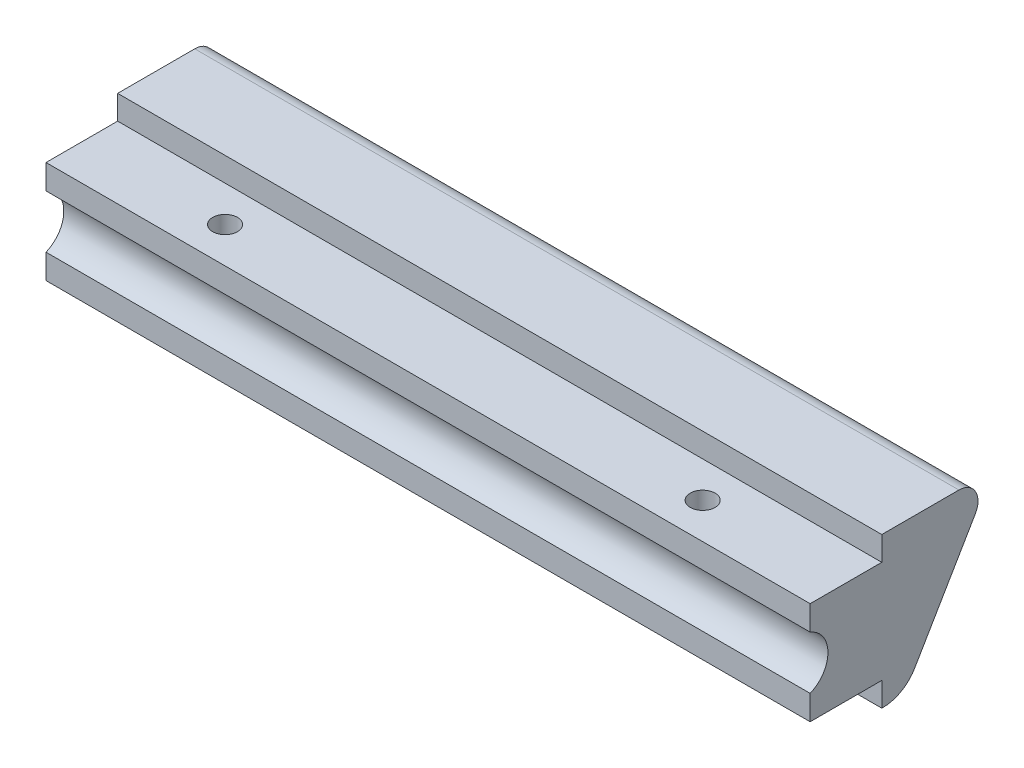
ISO-10303-21;
HEADER;
FILE_DESCRIPTION(('STEP AP214'),'2;1');
FILE_NAME('part.step','',(''),(''),'','','');
FILE_SCHEMA(('AUTOMOTIVE_DESIGN { 1 0 10303 214 1 1 1 1 }'));
ENDSEC;
DATA;
#1=APPLICATION_CONTEXT('core data for automotive mechanical design processes');
#2=APPLICATION_PROTOCOL_DEFINITION('international standard','automotive_design',2000,#1);
#3=PRODUCT_CONTEXT('',#1,'mechanical');
#4=PRODUCT('Part','Part','',(#3));
#5=PRODUCT_RELATED_PRODUCT_CATEGORY('part','',(#4));
#6=PRODUCT_DEFINITION_FORMATION('','',#4);
#7=PRODUCT_DEFINITION_CONTEXT('part definition',#1,'design');
#8=PRODUCT_DEFINITION('design','',#6,#7);
#9=PRODUCT_DEFINITION_SHAPE('','',#8);
#10=(LENGTH_UNIT() NAMED_UNIT(*) SI_UNIT(.MILLI.,.METRE.));
#11=(NAMED_UNIT(*) PLANE_ANGLE_UNIT() SI_UNIT($,.RADIAN.));
#12=(NAMED_UNIT(*) SI_UNIT($,.STERADIAN.) SOLID_ANGLE_UNIT());
#13=UNCERTAINTY_MEASURE_WITH_UNIT(LENGTH_MEASURE(1.E-05),#10,'distance_accuracy_value','');
#14=(GEOMETRIC_REPRESENTATION_CONTEXT(3) GLOBAL_UNCERTAINTY_ASSIGNED_CONTEXT((#13)) GLOBAL_UNIT_ASSIGNED_CONTEXT((#10,
#11,#12)) REPRESENTATION_CONTEXT('',''));
#15=CARTESIAN_POINT('',(0.,0.,0.));
#16=DIRECTION('',(0.,0.,1.));
#17=DIRECTION('',(1.,0.,0.));
#18=AXIS2_PLACEMENT_3D('',#15,#16,#17);
#19=CARTESIAN_POINT('',(101.6,16.7996,0.));
#20=DIRECTION('',(0.,0.,-1.));
#21=DIRECTION('',(0.,1.,0.));
#22=AXIS2_PLACEMENT_3D('',#19,#20,#21);
#23=PLANE('',#22);
#24=DIRECTION('',(0.,-1.,0.));
#25=VECTOR('',#24,1.);
#26=CARTESIAN_POINT('',(101.6,16.7996,0.));
#27=LINE('',#26,#25);
#28=CARTESIAN_POINT('',(101.6,6.4737188141613,0.));
#29=VERTEX_POINT('',#28);
#30=CARTESIAN_POINT('',(101.6,3.2004,0.));
#31=VERTEX_POINT('',#30);
#32=EDGE_CURVE('E138',#29,#31,#27,.T.);
#33=ORIENTED_EDGE('',*,*,#32,.F.);
#34=DIRECTION('',(-1.,0.,0.));
#35=VECTOR('',#34,1.);
#36=CARTESIAN_POINT('',(109.039264117156,6.4737188141613,0.));
#37=LINE('',#36,#35);
#38=CARTESIAN_POINT('',(0.,6.4737188141613,0.));
#39=VERTEX_POINT('',#38);
#40=EDGE_CURVE('E124',#29,#39,#37,.T.);
#41=ORIENTED_EDGE('',*,*,#40,.T.);
#42=DIRECTION('',(0.,-1.,0.));
#43=VECTOR('',#42,1.);
#44=CARTESIAN_POINT('',(0.,16.7996,0.));
#45=LINE('',#44,#43);
#46=CARTESIAN_POINT('',(0.,3.2004,0.));
#47=VERTEX_POINT('',#46);
#48=EDGE_CURVE('E136',#39,#47,#45,.T.);
#49=ORIENTED_EDGE('',*,*,#48,.T.);
#50=DIRECTION('',(-1.,0.,0.));
#51=VECTOR('',#50,1.);
#52=CARTESIAN_POINT('',(101.6,3.2004,0.));
#53=LINE('',#52,#51);
#54=EDGE_CURVE('E174',#31,#47,#53,.T.);
#55=ORIENTED_EDGE('',*,*,#54,.F.);
#56=EDGE_LOOP('',(#33,#41,#49,#55));
#57=FACE_BOUND('',#56,.T.);
#58=ADVANCED_FACE('F33',(#57),#23,.F.);
#59=CARTESIAN_POINT('',(101.6,20.,-24.2156234533446));
#60=DIRECTION('',(0.,-1.,0.));
#61=DIRECTION('',(0.,0.,-1.));
#62=AXIS2_PLACEMENT_3D('',#59,#60,#61);
#63=PLANE('',#62);
#64=DIRECTION('',(0.,0.,1.));
#65=VECTOR('',#64,1.);
#66=CARTESIAN_POINT('',(101.6,20.,-24.2156234533446));
#67=LINE('',#66,#65);
#68=CARTESIAN_POINT('',(101.6,20.,-19.7792045559382));
#69=VERTEX_POINT('',#68);
#70=CARTESIAN_POINT('',(101.6,20.,-9.525));
#71=VERTEX_POINT('',#70);
#72=EDGE_CURVE('E160',#69,#71,#67,.T.);
#73=ORIENTED_EDGE('',*,*,#72,.F.);
#74=DIRECTION('',(-1.,0.,0.));
#75=VECTOR('',#74,1.);
#76=CARTESIAN_POINT('',(101.6,20.,-19.7792045559382));
#77=LINE('',#76,#75);
#78=CARTESIAN_POINT('',(0.,20.,-19.7792045559382));
#79=VERTEX_POINT('',#78);
#80=EDGE_CURVE('E185',#69,#79,#77,.T.);
#81=ORIENTED_EDGE('',*,*,#80,.T.);
#82=DIRECTION('',(0.,0.,1.));
#83=VECTOR('',#82,1.);
#84=CARTESIAN_POINT('',(0.,20.,-24.2156234533446));
#85=LINE('',#84,#83);
#86=CARTESIAN_POINT('',(0.,20.,-9.525));
#87=VERTEX_POINT('',#86);
#88=EDGE_CURVE('E193',#79,#87,#85,.T.);
#89=ORIENTED_EDGE('',*,*,#88,.T.);
#90=DIRECTION('',(-1.,0.,0.));
#91=VECTOR('',#90,1.);
#92=CARTESIAN_POINT('',(101.6,20.,-9.525));
#93=LINE('',#92,#91);
#94=EDGE_CURVE('E182',#71,#87,#93,.T.);
#95=ORIENTED_EDGE('',*,*,#94,.F.);
#96=EDGE_LOOP('',(#73,#81,#89,#95));
#97=FACE_BOUND('',#96,.T.);
#98=ADVANCED_FACE('F191',(#97),#63,.F.);
#99=CARTESIAN_POINT('',(101.6,20.,-9.525));
#100=DIRECTION('',(0.,0.,-1.));
#101=DIRECTION('',(-1.,0.,0.));
#102=AXIS2_PLACEMENT_3D('',#99,#100,#101);
#103=PLANE('',#102);
#104=DIRECTION('',(0.,-1.,0.));
#105=VECTOR('',#104,1.);
#106=CARTESIAN_POINT('',(0.,20.,-9.525));
#107=LINE('',#106,#105);
#108=CARTESIAN_POINT('',(0.,16.7996,-9.525));
#109=VERTEX_POINT('',#108);
#110=EDGE_CURVE('E147',#87,#109,#107,.T.);
#111=ORIENTED_EDGE('',*,*,#110,.T.);
#112=DIRECTION('',(-1.,0.,0.));
#113=VECTOR('',#112,1.);
#114=CARTESIAN_POINT('',(101.6,16.7996,-9.525));
#115=LINE('',#114,#113);
#116=CARTESIAN_POINT('',(101.6,16.7996,-9.525));
#117=VERTEX_POINT('',#116);
#118=EDGE_CURVE('E179',#117,#109,#115,.T.);
#119=ORIENTED_EDGE('',*,*,#118,.F.);
#120=DIRECTION('',(0.,-1.,0.));
#121=VECTOR('',#120,1.);
#122=CARTESIAN_POINT('',(101.6,20.,-9.525));
#123=LINE('',#122,#121);
#124=EDGE_CURVE('E216',#71,#117,#123,.T.);
#125=ORIENTED_EDGE('',*,*,#124,.F.);
#126=ORIENTED_EDGE('',*,*,#94,.T.);
#127=EDGE_LOOP('',(#111,#119,#125,#126));
#128=FACE_BOUND('',#127,.T.);
#129=ADVANCED_FACE('F238',(#128),#103,.F.);
#130=CARTESIAN_POINT('',(101.6,16.7996,-9.525));
#131=DIRECTION('',(0.,-1.,0.));
#132=DIRECTION('',(0.,0.,-1.));
#133=AXIS2_PLACEMENT_3D('',#130,#131,#132);
#134=PLANE('',#133);
#135=CARTESIAN_POINT('',(19.05,16.7996,-4.76250000000001));
#136=DIRECTION('',(0.,1.,0.));
#137=DIRECTION('',(0.,0.,1.));
#138=AXIS2_PLACEMENT_3D('',#135,#136,#137);
#139=CIRCLE('',#138,1.651);
#140=CARTESIAN_POINT('',(19.05,16.7996,-3.11150000000001));
#141=VERTEX_POINT('',#140);
#142=EDGE_CURVE('E223',#141,#141,#139,.T.);
#143=ORIENTED_EDGE('',*,*,#142,.F.);
#144=EDGE_LOOP('',(#143));
#145=FACE_BOUND('',#144,.T.);
#146=CARTESIAN_POINT('',(82.55,16.7996,-4.76250000000005));
#147=DIRECTION('',(0.,1.,0.));
#148=DIRECTION('',(0.,0.,1.));
#149=AXIS2_PLACEMENT_3D('',#146,#147,#148);
#150=CIRCLE('',#149,1.65100000000001);
#151=CARTESIAN_POINT('',(82.55,16.7996,-3.11150000000004));
#152=VERTEX_POINT('',#151);
#153=EDGE_CURVE('E224',#152,#152,#150,.T.);
#154=ORIENTED_EDGE('',*,*,#153,.F.);
#155=EDGE_LOOP('',(#154));
#156=FACE_BOUND('',#155,.T.);
#157=DIRECTION('',(0.,0.,1.));
#158=VECTOR('',#157,1.);
#159=CARTESIAN_POINT('',(0.,16.7996,-9.525));
#160=LINE('',#159,#158);
#161=CARTESIAN_POINT('',(0.,16.7996,0.));
#162=VERTEX_POINT('',#161);
#163=EDGE_CURVE('E145',#109,#162,#160,.T.);
#164=ORIENTED_EDGE('',*,*,#163,.T.);
#165=DIRECTION('',(-1.,0.,0.));
#166=VECTOR('',#165,1.);
#167=CARTESIAN_POINT('',(101.6,16.7996,0.));
#168=LINE('',#167,#166);
#169=CARTESIAN_POINT('',(101.6,16.7996,0.));
#170=VERTEX_POINT('',#169);
#171=EDGE_CURVE('E176',#170,#162,#168,.T.);
#172=ORIENTED_EDGE('',*,*,#171,.F.);
#173=DIRECTION('',(0.,0.,1.));
#174=VECTOR('',#173,1.);
#175=CARTESIAN_POINT('',(101.6,16.7996,-9.525));
#176=LINE('',#175,#174);
#177=EDGE_CURVE('E214',#117,#170,#176,.T.);
#178=ORIENTED_EDGE('',*,*,#177,.F.);
#179=ORIENTED_EDGE('',*,*,#118,.T.);
#180=EDGE_LOOP('',(#164,#172,#178,#179));
#181=FACE_BOUND('',#180,.T.);
#182=ADVANCED_FACE('F234',(#145,#156,#181),#134,.F.);
#183=CARTESIAN_POINT('',(0.,13.5262811858387,0.));
#184=VERTEX_POINT('',#183);
#185=EDGE_CURVE('E144',#162,#184,#45,.T.);
#186=ORIENTED_EDGE('',*,*,#185,.T.);
#187=DIRECTION('',(-1.,0.,0.));
#188=VECTOR('',#187,1.);
#189=CARTESIAN_POINT('',(109.039264117156,13.5262811858387,0.));
#190=LINE('',#189,#188);
#191=CARTESIAN_POINT('',(101.6,13.5262811858387,0.));
#192=VERTEX_POINT('',#191);
#193=EDGE_CURVE('E127',#192,#184,#190,.T.);
#194=ORIENTED_EDGE('',*,*,#193,.F.);
#195=EDGE_CURVE('E211',#170,#192,#27,.T.);
#196=ORIENTED_EDGE('',*,*,#195,.F.);
#197=ORIENTED_EDGE('',*,*,#171,.T.);
#198=EDGE_LOOP('',(#186,#194,#196,#197));
#199=FACE_BOUND('',#198,.T.);
#200=ADVANCED_FACE('F237',(#199),#23,.F.);
#201=CARTESIAN_POINT('',(101.6,3.2004,0.));
#202=DIRECTION('',(0.,1.,0.));
#203=DIRECTION('',(0.,0.,1.));
#204=AXIS2_PLACEMENT_3D('',#201,#202,#203);
#205=PLANE('',#204);
#206=CARTESIAN_POINT('',(19.05,3.2004,-4.76250000000001));
#207=DIRECTION('',(0.,1.,0.));
#208=DIRECTION('',(0.,0.,1.));
#209=AXIS2_PLACEMENT_3D('',#206,#207,#208);
#210=CIRCLE('',#209,1.651);
#211=CARTESIAN_POINT('',(19.05,3.2004,-3.11150000000002));
#212=VERTEX_POINT('',#211);
#213=EDGE_CURVE('E131',#212,#212,#210,.F.);
#214=ORIENTED_EDGE('',*,*,#213,.F.);
#215=EDGE_LOOP('',(#214));
#216=FACE_BOUND('',#215,.T.);
#217=CARTESIAN_POINT('',(82.55,3.2004,-4.76250000000005));
#218=DIRECTION('',(0.,1.,0.));
#219=DIRECTION('',(0.,0.,1.));
#220=AXIS2_PLACEMENT_3D('',#217,#218,#219);
#221=CIRCLE('',#220,1.65100000000001);
#222=CARTESIAN_POINT('',(82.55,3.2004,-3.11150000000005));
#223=VERTEX_POINT('',#222);
#224=EDGE_CURVE('E220',#223,#223,#221,.F.);
#225=ORIENTED_EDGE('',*,*,#224,.F.);
#226=EDGE_LOOP('',(#225));
#227=FACE_BOUND('',#226,.T.);
#228=DIRECTION('',(0.,0.,-1.));
#229=VECTOR('',#228,1.);
#230=CARTESIAN_POINT('',(0.,3.2004,0.));
#231=LINE('',#230,#229);
#232=CARTESIAN_POINT('',(0.,3.2004,-9.525));
#233=VERTEX_POINT('',#232);
#234=EDGE_CURVE('E143',#47,#233,#231,.T.);
#235=ORIENTED_EDGE('',*,*,#234,.T.);
#236=DIRECTION('',(-1.,0.,0.));
#237=VECTOR('',#236,1.);
#238=CARTESIAN_POINT('',(101.6,3.2004,-9.525));
#239=LINE('',#238,#237);
#240=CARTESIAN_POINT('',(101.6,3.2004,-9.525));
#241=VERTEX_POINT('',#240);
#242=EDGE_CURVE('E171',#241,#233,#239,.T.);
#243=ORIENTED_EDGE('',*,*,#242,.F.);
#244=DIRECTION('',(0.,0.,-1.));
#245=VECTOR('',#244,1.);
#246=CARTESIAN_POINT('',(101.6,3.2004,0.));
#247=LINE('',#246,#245);
#248=EDGE_CURVE('E209',#31,#241,#247,.T.);
#249=ORIENTED_EDGE('',*,*,#248,.F.);
#250=ORIENTED_EDGE('',*,*,#54,.T.);
#251=EDGE_LOOP('',(#235,#243,#249,#250));
#252=FACE_BOUND('',#251,.T.);
#253=ADVANCED_FACE('F262',(#216,#227,#252),#205,.F.);
#254=CARTESIAN_POINT('',(101.6,3.2004,-9.525));
#255=DIRECTION('',(0.,0.,-1.));
#256=DIRECTION('',(0.,1.,0.));
#257=AXIS2_PLACEMENT_3D('',#254,#255,#256);
#258=PLANE('',#257);
#259=DIRECTION('',(0.,-1.,0.));
#260=VECTOR('',#259,1.);
#261=CARTESIAN_POINT('',(0.,3.2004,-9.525));
#262=LINE('',#261,#260);
#263=CARTESIAN_POINT('',(0.,0.,-9.525));
#264=VERTEX_POINT('',#263);
#265=EDGE_CURVE('E152',#233,#264,#262,.T.);
#266=ORIENTED_EDGE('',*,*,#265,.T.);
#267=DIRECTION('',(-1.,0.,0.));
#268=VECTOR('',#267,1.);
#269=CARTESIAN_POINT('',(101.6,0.,-9.525));
#270=LINE('',#269,#268);
#271=CARTESIAN_POINT('',(101.6,0.,-9.525));
#272=VERTEX_POINT('',#271);
#273=EDGE_CURVE('E168',#272,#264,#270,.T.);
#274=ORIENTED_EDGE('',*,*,#273,.F.);
#275=DIRECTION('',(0.,-1.,0.));
#276=VECTOR('',#275,1.);
#277=CARTESIAN_POINT('',(101.6,3.2004,-9.525));
#278=LINE('',#277,#276);
#279=EDGE_CURVE('E207',#241,#272,#278,.T.);
#280=ORIENTED_EDGE('',*,*,#279,.F.);
#281=ORIENTED_EDGE('',*,*,#242,.T.);
#282=EDGE_LOOP('',(#266,#274,#280,#281));
#283=FACE_BOUND('',#282,.T.);
#284=ADVANCED_FACE('F266',(#283),#258,.F.);
#285=CARTESIAN_POINT('',(101.6,0.,-9.67200120834093));
#286=DIRECTION('',(0.,1.,0.));
#287=DIRECTION('',(0.,0.,1.));
#288=AXIS2_PLACEMENT_3D('',#285,#286,#287);
#289=PLANE('',#288);
#290=DIRECTION('',(0.,0.,-1.));
#291=VECTOR('',#290,1.);
#292=CARTESIAN_POINT('',(0.,0.,-9.67200120834093));
#293=LINE('',#292,#291);
#294=CARTESIAN_POINT('',(0.,0.,-9.67200120834093));
#295=VERTEX_POINT('',#294);
#296=EDGE_CURVE('E154',#264,#295,#293,.T.);
#297=ORIENTED_EDGE('',*,*,#296,.T.);
#298=DIRECTION('',(-1.,0.,0.));
#299=VECTOR('',#298,1.);
#300=CARTESIAN_POINT('',(101.6,0.,-9.67200120834093));
#301=LINE('',#300,#299);
#302=CARTESIAN_POINT('',(101.6,0.,-9.67200120834093));
#303=VERTEX_POINT('',#302);
#304=EDGE_CURVE('E164',#303,#295,#301,.T.);
#305=ORIENTED_EDGE('',*,*,#304,.F.);
#306=DIRECTION('',(0.,0.,-1.));
#307=VECTOR('',#306,1.);
#308=CARTESIAN_POINT('',(101.6,0.,-9.67200120834093));
#309=LINE('',#308,#307);
#310=EDGE_CURVE('E205',#272,#303,#309,.T.);
#311=ORIENTED_EDGE('',*,*,#310,.F.);
#312=ORIENTED_EDGE('',*,*,#273,.T.);
#313=EDGE_LOOP('',(#297,#305,#311,#312));
#314=FACE_BOUND('',#313,.T.);
#315=ADVANCED_FACE('F271',(#314),#289,.F.);
#316=CARTESIAN_POINT('',(101.6,4.89533435134192,-9.67200120834093));
#317=DIRECTION('',(-1.,0.,0.));
#318=DIRECTION('',(0.,0.,1.));
#319=AXIS2_PLACEMENT_3D('',#316,#317,#318);
#320=CYLINDRICAL_SURFACE('',#319,4.89533435134192);
#321=CARTESIAN_POINT('',(0.,4.89533435134192,-9.67200120834093));
#322=DIRECTION('',(1.,0.,0.));
#323=DIRECTION('',(0.,0.,1.));
#324=AXIS2_PLACEMENT_3D('',#321,#322,#323);
#325=CIRCLE('',#324,4.89533435134192);
#326=CARTESIAN_POINT('',(0.,2.4170390254288,-13.893653809987));
#327=VERTEX_POINT('',#326);
#328=EDGE_CURVE('E156',#295,#327,#325,.T.);
#329=ORIENTED_EDGE('',*,*,#328,.T.);
#330=DIRECTION('',(-1.,0.,0.));
#331=VECTOR('',#330,1.);
#332=CARTESIAN_POINT('',(101.6,2.4170390254288,-13.893653809987));
#333=LINE('',#332,#331);
#334=CARTESIAN_POINT('',(101.6,2.4170390254288,-13.893653809987));
#335=VERTEX_POINT('',#334);
#336=EDGE_CURVE('E161',#335,#327,#333,.T.);
#337=ORIENTED_EDGE('',*,*,#336,.F.);
#338=CARTESIAN_POINT('',(101.6,4.89533435134192,-9.67200120834093));
#339=DIRECTION('',(1.,0.,0.));
#340=DIRECTION('',(0.,0.,1.));
#341=AXIS2_PLACEMENT_3D('',#338,#339,#340);
#342=CIRCLE('',#341,4.89533435134192);
#343=EDGE_CURVE('E203',#303,#335,#342,.T.);
#344=ORIENTED_EDGE('',*,*,#343,.F.);
#345=ORIENTED_EDGE('',*,*,#304,.T.);
#346=EDGE_LOOP('',(#329,#337,#344,#345));
#347=FACE_BOUND('',#346,.T.);
#348=ADVANCED_FACE('F279',(#347),#320,.T.);
#349=CARTESIAN_POINT('',(101.6,20.,-24.2156234533446));
#350=DIRECTION('',(0.,0.506256600273639,0.862382893313276));
#351=DIRECTION('',(0.,-0.862382893313276,0.506256600273639));
#352=AXIS2_PLACEMENT_3D('',#349,#350,#351);
#353=PLANE('',#352);
#354=DIRECTION('',(0.,0.862382893313276,-0.506256600273639));
#355=VECTOR('',#354,1.);
#356=CARTESIAN_POINT('',(0.,20.,-24.2156234533446));
#357=LINE('',#356,#355);
#358=CARTESIAN_POINT('',(0.,16.174108235305,-21.9696571049539));
#359=VERTEX_POINT('',#358);
#360=EDGE_CURVE('E158',#327,#359,#357,.T.);
#361=ORIENTED_EDGE('',*,*,#360,.T.);
#362=DIRECTION('',(-1.,0.,0.));
#363=VECTOR('',#362,1.);
#364=CARTESIAN_POINT('',(101.6,16.174108235305,-21.9696571049539));
#365=LINE('',#364,#363);
#366=CARTESIAN_POINT('',(101.6,16.174108235305,-21.9696571049539));
#367=VERTEX_POINT('',#366);
#368=EDGE_CURVE('E41',#359,#367,#365,.F.);
#369=ORIENTED_EDGE('',*,*,#368,.T.);
#370=DIRECTION('',(0.,0.862382893313276,-0.506256600273639));
#371=VECTOR('',#370,1.);
#372=CARTESIAN_POINT('',(101.6,20.,-24.2156234533446));
#373=LINE('',#372,#371);
#374=EDGE_CURVE('E165',#335,#367,#373,.T.);
#375=ORIENTED_EDGE('',*,*,#374,.F.);
#376=ORIENTED_EDGE('',*,*,#336,.T.);
#377=EDGE_LOOP('',(#361,#369,#375,#376));
#378=FACE_BOUND('',#377,.T.);
#379=ADVANCED_FACE('F283',(#378),#353,.F.);
#380=CARTESIAN_POINT('',(101.6,4.89533435134192,-9.67200120834093));
#381=DIRECTION('',(-1.,0.,0.));
#382=DIRECTION('',(0.,0.,1.));
#383=AXIS2_PLACEMENT_3D('',#380,#381,#382);
#384=PLANE('',#383);
#385=ORIENTED_EDGE('',*,*,#374,.T.);
#386=CARTESIAN_POINT('',(101.6,17.46,-19.7792045559382));
#387=DIRECTION('',(-1.,0.,0.));
#388=DIRECTION('',(0.,0.,1.));
#389=AXIS2_PLACEMENT_3D('',#386,#387,#388);
#390=CIRCLE('',#389,2.54);
#391=EDGE_CURVE('E11',#367,#69,#390,.F.);
#392=ORIENTED_EDGE('',*,*,#391,.T.);
#393=ORIENTED_EDGE('',*,*,#72,.T.);
#394=ORIENTED_EDGE('',*,*,#124,.T.);
#395=ORIENTED_EDGE('',*,*,#177,.T.);
#396=ORIENTED_EDGE('',*,*,#195,.T.);
#397=CARTESIAN_POINT('',(101.6,10.,1.44272));
#398=DIRECTION('',(-1.,0.,0.));
#399=DIRECTION('',(0.,0.,1.));
#400=AXIS2_PLACEMENT_3D('',#397,#398,#399);
#401=CIRCLE('',#400,3.81);
#402=EDGE_CURVE('E198',#29,#192,#401,.F.);
#403=ORIENTED_EDGE('',*,*,#402,.F.);
#404=ORIENTED_EDGE('',*,*,#32,.T.);
#405=ORIENTED_EDGE('',*,*,#248,.T.);
#406=ORIENTED_EDGE('',*,*,#279,.T.);
#407=ORIENTED_EDGE('',*,*,#310,.T.);
#408=ORIENTED_EDGE('',*,*,#343,.T.);
#409=EDGE_LOOP('',(#385,#392,#393,#394,#395,#396,#403,#404,#405,#406,#407,#408));
#410=FACE_BOUND('',#409,.T.);
#411=ADVANCED_FACE('F248',(#410),#384,.F.);
#412=CARTESIAN_POINT('',(0.,4.89533435134192,-9.67200120834093));
#413=DIRECTION('',(-1.,0.,0.));
#414=DIRECTION('',(0.,0.,1.));
#415=AXIS2_PLACEMENT_3D('',#412,#413,#414);
#416=PLANE('',#415);
#417=ORIENTED_EDGE('',*,*,#88,.F.);
#418=CARTESIAN_POINT('',(0.,17.46,-19.7792045559382));
#419=DIRECTION('',(-1.,0.,0.));
#420=DIRECTION('',(0.,0.,1.));
#421=AXIS2_PLACEMENT_3D('',#418,#419,#420);
#422=CIRCLE('',#421,2.54);
#423=EDGE_CURVE('E55',#79,#359,#422,.T.);
#424=ORIENTED_EDGE('',*,*,#423,.T.);
#425=ORIENTED_EDGE('',*,*,#360,.F.);
#426=ORIENTED_EDGE('',*,*,#328,.F.);
#427=ORIENTED_EDGE('',*,*,#296,.F.);
#428=ORIENTED_EDGE('',*,*,#265,.F.);
#429=ORIENTED_EDGE('',*,*,#234,.F.);
#430=ORIENTED_EDGE('',*,*,#48,.F.);
#431=CARTESIAN_POINT('',(0.,10.,1.44272));
#432=DIRECTION('',(-1.,0.,0.));
#433=DIRECTION('',(0.,0.,1.));
#434=AXIS2_PLACEMENT_3D('',#431,#432,#433);
#435=CIRCLE('',#434,3.81);
#436=EDGE_CURVE('E121',#184,#39,#435,.T.);
#437=ORIENTED_EDGE('',*,*,#436,.F.);
#438=ORIENTED_EDGE('',*,*,#185,.F.);
#439=ORIENTED_EDGE('',*,*,#163,.F.);
#440=ORIENTED_EDGE('',*,*,#110,.F.);
#441=EDGE_LOOP('',(#417,#424,#425,#426,#427,#428,#429,#430,#437,#438,#439,#440));
#442=FACE_BOUND('',#441,.T.);
#443=ADVANCED_FACE('F141',(#442),#416,.T.);
#444=CARTESIAN_POINT('',(109.039264117156,10.,1.44272));
#445=DIRECTION('',(-1.,0.,0.));
#446=DIRECTION('',(0.,0.,1.));
#447=AXIS2_PLACEMENT_3D('',#444,#445,#446);
#448=CYLINDRICAL_SURFACE('',#447,3.81);
#449=ORIENTED_EDGE('',*,*,#402,.T.);
#450=ORIENTED_EDGE('',*,*,#193,.T.);
#451=ORIENTED_EDGE('',*,*,#436,.T.);
#452=ORIENTED_EDGE('',*,*,#40,.F.);
#453=EDGE_LOOP('',(#449,#450,#451,#452));
#454=FACE_BOUND('',#453,.T.);
#455=ADVANCED_FACE('F123',(#454),#448,.F.);
#456=CARTESIAN_POINT('',(82.55,-1.46933318295597,-4.76250000000005));
#457=DIRECTION('',(0.,1.,0.));
#458=DIRECTION('',(0.,0.,1.));
#459=AXIS2_PLACEMENT_3D('',#456,#457,#458);
#460=CYLINDRICAL_SURFACE('',#459,1.65100000000001);
#461=ORIENTED_EDGE('',*,*,#224,.T.);
#462=EDGE_LOOP('',(#461));
#463=FACE_BOUND('',#462,.T.);
#464=ORIENTED_EDGE('',*,*,#153,.T.);
#465=EDGE_LOOP('',(#464));
#466=FACE_BOUND('',#465,.T.);
#467=ADVANCED_FACE('F293',(#463,#466),#460,.F.);
#468=CARTESIAN_POINT('',(19.05,-1.46933318295597,-4.76250000000002));
#469=DIRECTION('',(0.,1.,0.));
#470=DIRECTION('',(0.,0.,1.));
#471=AXIS2_PLACEMENT_3D('',#468,#469,#470);
#472=CYLINDRICAL_SURFACE('',#471,1.651);
#473=ORIENTED_EDGE('',*,*,#213,.T.);
#474=EDGE_LOOP('',(#473));
#475=FACE_BOUND('',#474,.T.);
#476=ORIENTED_EDGE('',*,*,#142,.T.);
#477=EDGE_LOOP('',(#476));
#478=FACE_BOUND('',#477,.T.);
#479=ADVANCED_FACE('F232',(#475,#478),#472,.F.);
#480=CARTESIAN_POINT('',(101.6,17.46,-19.7792045559382));
#481=DIRECTION('',(-1.,0.,0.));
#482=DIRECTION('',(0.,0.,1.));
#483=AXIS2_PLACEMENT_3D('',#480,#481,#482);
#484=CYLINDRICAL_SURFACE('',#483,2.54);
#485=ORIENTED_EDGE('',*,*,#391,.F.);
#486=ORIENTED_EDGE('',*,*,#368,.F.);
#487=ORIENTED_EDGE('',*,*,#423,.F.);
#488=ORIENTED_EDGE('',*,*,#80,.F.);
#489=EDGE_LOOP('',(#485,#486,#487,#488));
#490=FACE_BOUND('',#489,.T.);
#491=ADVANCED_FACE('F35',(#490),#484,.T.);
#492=CLOSED_SHELL('',(#58,#98,#129,#182,#200,#253,#284,#315,#348,#379,#411,#443,#455,#467,#479,#491));
#493=MANIFOLD_SOLID_BREP('B2',#492);
#494=ADVANCED_BREP_SHAPE_REPRESENTATION('',(#18,#493),#14);
#495=SHAPE_DEFINITION_REPRESENTATION(#9,#494);
ENDSEC;
END-ISO-10303-21;
